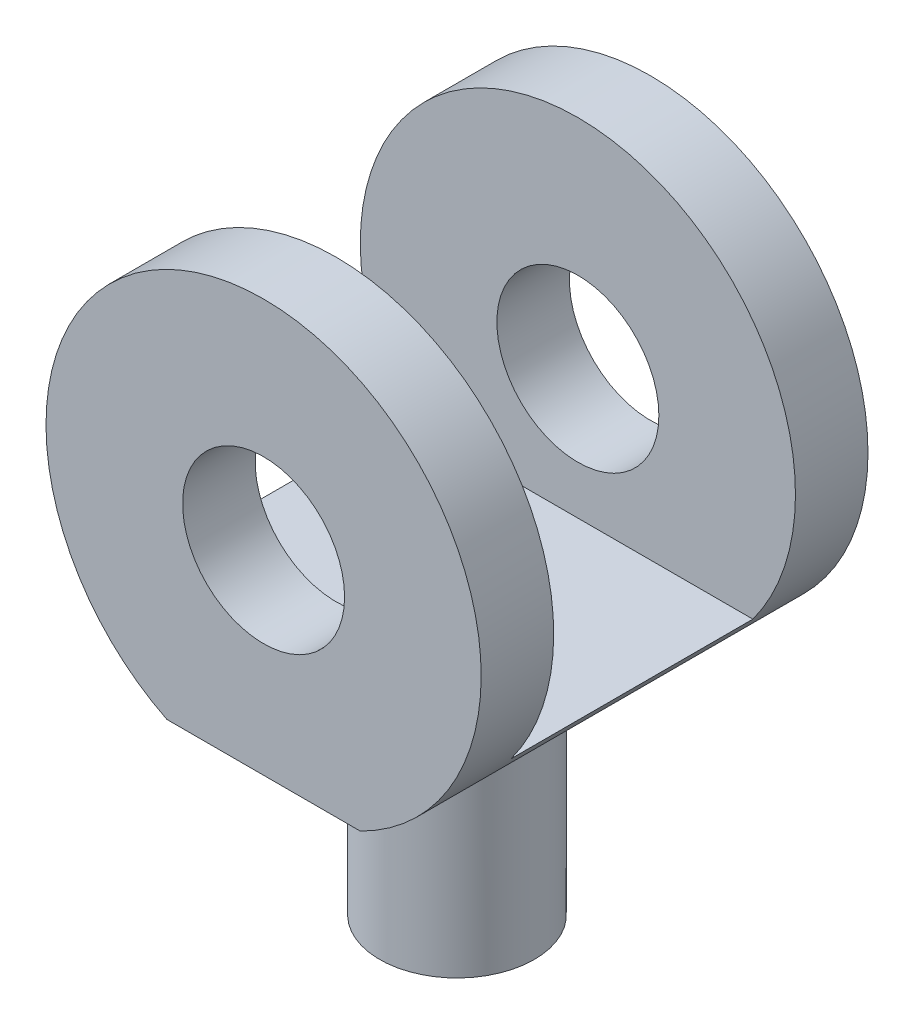
ISO-10303-21;
HEADER;
FILE_DESCRIPTION(('STEP AP214'),'2;1');
FILE_NAME('part.step','',(''),(''),'','','');
FILE_SCHEMA(('AUTOMOTIVE_DESIGN { 1 0 10303 214 1 1 1 1 }'));
ENDSEC;
DATA;
#1=APPLICATION_CONTEXT('core data for automotive mechanical design processes');
#2=APPLICATION_PROTOCOL_DEFINITION('international standard','automotive_design',2000,#1);
#3=PRODUCT_CONTEXT('',#1,'mechanical');
#4=PRODUCT('Part','Part','',(#3));
#5=PRODUCT_RELATED_PRODUCT_CATEGORY('part','',(#4));
#6=PRODUCT_DEFINITION_FORMATION('','',#4);
#7=PRODUCT_DEFINITION_CONTEXT('part definition',#1,'design');
#8=PRODUCT_DEFINITION('design','',#6,#7);
#9=PRODUCT_DEFINITION_SHAPE('','',#8);
#10=(LENGTH_UNIT() NAMED_UNIT(*) SI_UNIT(.MILLI.,.METRE.));
#11=(NAMED_UNIT(*) PLANE_ANGLE_UNIT() SI_UNIT($,.RADIAN.));
#12=(NAMED_UNIT(*) SI_UNIT($,.STERADIAN.) SOLID_ANGLE_UNIT());
#13=UNCERTAINTY_MEASURE_WITH_UNIT(LENGTH_MEASURE(1.E-05),#10,'distance_accuracy_value','');
#14=(GEOMETRIC_REPRESENTATION_CONTEXT(3) GLOBAL_UNCERTAINTY_ASSIGNED_CONTEXT((#13)) GLOBAL_UNIT_ASSIGNED_CONTEXT((#10,
#11,#12)) REPRESENTATION_CONTEXT('',''));
#15=CARTESIAN_POINT('',(0.,0.,0.));
#16=DIRECTION('',(0.,0.,1.));
#17=DIRECTION('',(1.,0.,0.));
#18=AXIS2_PLACEMENT_3D('',#15,#16,#17);
#19=CARTESIAN_POINT('',(13.,-4.03112887414927,4.));
#20=DIRECTION('',(0.,1.,0.));
#21=DIRECTION('',(0.,0.,1.));
#22=AXIS2_PLACEMENT_3D('',#19,#20,#21);
#23=PLANE('',#22);
#24=DIRECTION('',(0.,0.,-1.));
#25=VECTOR('',#24,1.);
#26=CARTESIAN_POINT('',(17.,-4.03112887414927,4.));
#27=LINE('',#26,#25);
#28=CARTESIAN_POINT('',(17.,-4.03112887414927,-0.640312423743286));
#29=VERTEX_POINT('',#28);
#30=CARTESIAN_POINT('',(17.,-4.03112887414927,-4.));
#31=VERTEX_POINT('',#30);
#32=EDGE_CURVE('E147',#29,#31,#27,.T.);
#33=ORIENTED_EDGE('',*,*,#32,.F.);
#34=CARTESIAN_POINT('',(15.,-4.03112887414927,0.));
#35=DIRECTION('',(0.,1.,0.));
#36=DIRECTION('',(0.,0.,1.));
#37=AXIS2_PLACEMENT_3D('',#34,#35,#36);
#38=CIRCLE('',#37,2.1);
#39=CARTESIAN_POINT('',(13.,-4.03112887414927,-0.640312423743292));
#40=VERTEX_POINT('',#39);
#41=EDGE_CURVE('E11',#29,#40,#38,.T.);
#42=ORIENTED_EDGE('',*,*,#41,.T.);
#43=DIRECTION('',(0.,0.,-1.));
#44=VECTOR('',#43,1.);
#45=CARTESIAN_POINT('',(13.,-4.03112887414927,4.));
#46=LINE('',#45,#44);
#47=CARTESIAN_POINT('',(13.,-4.03112887414927,-4.));
#48=VERTEX_POINT('',#47);
#49=EDGE_CURVE('E155',#40,#48,#46,.T.);
#50=ORIENTED_EDGE('',*,*,#49,.T.);
#51=DIRECTION('',(1.,0.,0.));
#52=VECTOR('',#51,1.);
#53=CARTESIAN_POINT('',(13.,-4.03112887414927,-4.));
#54=LINE('',#53,#52);
#55=EDGE_CURVE('E145',#48,#31,#54,.T.);
#56=ORIENTED_EDGE('',*,*,#55,.T.);
#57=EDGE_LOOP('',(#33,#42,#50,#56));
#58=FACE_BOUND('',#57,.T.);
#59=ADVANCED_FACE('F38',(#58),#23,.F.);
#60=CARTESIAN_POINT('',(15.,0.,4.));
#61=DIRECTION('',(0.,0.,-1.));
#62=DIRECTION('',(-1.,0.,0.));
#63=AXIS2_PLACEMENT_3D('',#60,#61,#62);
#64=CYLINDRICAL_SURFACE('',#63,4.5);
#65=CARTESIAN_POINT('',(15.,0.,-4.));
#66=DIRECTION('',(0.,0.,1.));
#67=DIRECTION('',(1.,0.,0.));
#68=AXIS2_PLACEMENT_3D('',#65,#66,#67);
#69=CIRCLE('',#68,4.5);
#70=EDGE_CURVE('E136',#31,#48,#69,.T.);
#71=ORIENTED_EDGE('',*,*,#70,.T.);
#72=ORIENTED_EDGE('',*,*,#49,.F.);
#73=CARTESIAN_POINT('',(13.,-4.03112887414927,0.640312423743292));
#74=VERTEX_POINT('',#73);
#75=EDGE_CURVE('E64',#74,#40,#46,.T.);
#76=ORIENTED_EDGE('',*,*,#75,.F.);
#77=CARTESIAN_POINT('',(13.,-4.03112887414927,4.));
#78=VERTEX_POINT('',#77);
#79=EDGE_CURVE('E157',#78,#74,#46,.T.);
#80=ORIENTED_EDGE('',*,*,#79,.F.);
#81=CARTESIAN_POINT('',(15.,0.,4.));
#82=DIRECTION('',(0.,0.,1.));
#83=DIRECTION('',(1.,0.,0.));
#84=AXIS2_PLACEMENT_3D('',#81,#82,#83);
#85=CIRCLE('',#84,4.5);
#86=CARTESIAN_POINT('',(17.,-4.03112887414927,4.));
#87=VERTEX_POINT('',#86);
#88=EDGE_CURVE('E141',#87,#78,#85,.T.);
#89=ORIENTED_EDGE('',*,*,#88,.F.);
#90=CARTESIAN_POINT('',(17.,-4.03112887414927,0.640312423743286));
#91=VERTEX_POINT('',#90);
#92=EDGE_CURVE('E152',#87,#91,#27,.T.);
#93=ORIENTED_EDGE('',*,*,#92,.T.);
#94=EDGE_CURVE('E156',#91,#29,#27,.T.);
#95=ORIENTED_EDGE('',*,*,#94,.T.);
#96=ORIENTED_EDGE('',*,*,#32,.T.);
#97=EDGE_LOOP('',(#71,#72,#76,#80,#89,#93,#95,#96));
#98=FACE_BOUND('',#97,.T.);
#99=CARTESIAN_POINT('',(15.,0.,-2.5));
#100=DIRECTION('',(0.,0.,1.));
#101=DIRECTION('',(1.,0.,0.));
#102=AXIS2_PLACEMENT_3D('',#99,#100,#101);
#103=CIRCLE('',#102,4.5);
#104=CARTESIAN_POINT('',(18.618615066569,-2.675,-2.5));
#105=VERTEX_POINT('',#104);
#106=CARTESIAN_POINT('',(11.381384933431,-2.675,-2.5));
#107=VERTEX_POINT('',#106);
#108=EDGE_CURVE('E109',#105,#107,#103,.T.);
#109=ORIENTED_EDGE('',*,*,#108,.F.);
#110=DIRECTION('',(0.,0.,1.));
#111=VECTOR('',#110,1.);
#112=CARTESIAN_POINT('',(18.618615066569,-2.675,-2.5));
#113=LINE('',#112,#111);
#114=CARTESIAN_POINT('',(18.618615066569,-2.675,2.5));
#115=VERTEX_POINT('',#114);
#116=EDGE_CURVE('E124',#105,#115,#113,.T.);
#117=ORIENTED_EDGE('',*,*,#116,.T.);
#118=CARTESIAN_POINT('',(15.,0.,2.5));
#119=DIRECTION('',(0.,0.,1.));
#120=DIRECTION('',(1.,0.,0.));
#121=AXIS2_PLACEMENT_3D('',#118,#119,#120);
#122=CIRCLE('',#121,4.5);
#123=CARTESIAN_POINT('',(11.381384933431,-2.675,2.5));
#124=VERTEX_POINT('',#123);
#125=EDGE_CURVE('E127',#115,#124,#122,.T.);
#126=ORIENTED_EDGE('',*,*,#125,.T.);
#127=DIRECTION('',(0.,0.,1.));
#128=VECTOR('',#127,1.);
#129=CARTESIAN_POINT('',(11.381384933431,-2.675,-2.5));
#130=LINE('',#129,#128);
#131=EDGE_CURVE('E122',#107,#124,#130,.T.);
#132=ORIENTED_EDGE('',*,*,#131,.F.);
#133=EDGE_LOOP('',(#109,#117,#126,#132));
#134=FACE_BOUND('',#133,.T.);
#135=ADVANCED_FACE('F126',(#98,#134),#64,.T.);
#136=CARTESIAN_POINT('',(15.,0.,4.));
#137=DIRECTION('',(0.,0.,-1.));
#138=DIRECTION('',(-1.,0.,0.));
#139=AXIS2_PLACEMENT_3D('',#136,#137,#138);
#140=CYLINDRICAL_SURFACE('',#139,1.675);
#141=CARTESIAN_POINT('',(15.,0.,-4.));
#142=DIRECTION('',(0.,0.,1.));
#143=DIRECTION('',(1.,0.,0.));
#144=AXIS2_PLACEMENT_3D('',#141,#142,#143);
#145=CIRCLE('',#144,1.675);
#146=CARTESIAN_POINT('',(16.675,0.,-4.));
#147=VERTEX_POINT('',#146);
#148=EDGE_CURVE('E137',#147,#147,#145,.T.);
#149=ORIENTED_EDGE('',*,*,#148,.F.);
#150=EDGE_LOOP('',(#149));
#151=FACE_BOUND('',#150,.T.);
#152=CARTESIAN_POINT('',(15.,0.,-2.5));
#153=DIRECTION('',(0.,0.,1.));
#154=DIRECTION('',(1.,0.,0.));
#155=AXIS2_PLACEMENT_3D('',#152,#153,#154);
#156=CIRCLE('',#155,1.675);
#157=CARTESIAN_POINT('',(16.675,0.,-2.5));
#158=VERTEX_POINT('',#157);
#159=EDGE_CURVE('E140',#158,#158,#156,.T.);
#160=ORIENTED_EDGE('',*,*,#159,.T.);
#161=EDGE_LOOP('',(#160));
#162=FACE_BOUND('',#161,.T.);
#163=ADVANCED_FACE('F238',(#151,#162),#140,.F.);
#164=CARTESIAN_POINT('',(15.,0.,4.));
#165=DIRECTION('',(0.,0.,1.));
#166=DIRECTION('',(1.,0.,0.));
#167=AXIS2_PLACEMENT_3D('',#164,#165,#166);
#168=PLANE('',#167);
#169=ORIENTED_EDGE('',*,*,#88,.T.);
#170=DIRECTION('',(1.,0.,0.));
#171=VECTOR('',#170,1.);
#172=CARTESIAN_POINT('',(13.,-4.03112887414927,4.));
#173=LINE('',#172,#171);
#174=EDGE_CURVE('E144',#78,#87,#173,.T.);
#175=ORIENTED_EDGE('',*,*,#174,.T.);
#176=EDGE_LOOP('',(#169,#175));
#177=FACE_BOUND('',#176,.T.);
#178=CARTESIAN_POINT('',(15.,0.,4.));
#179=DIRECTION('',(0.,0.,1.));
#180=DIRECTION('',(1.,0.,0.));
#181=AXIS2_PLACEMENT_3D('',#178,#179,#180);
#182=CIRCLE('',#181,1.675);
#183=CARTESIAN_POINT('',(16.675,0.,4.));
#184=VERTEX_POINT('',#183);
#185=EDGE_CURVE('E133',#184,#184,#182,.T.);
#186=ORIENTED_EDGE('',*,*,#185,.F.);
#187=EDGE_LOOP('',(#186));
#188=FACE_BOUND('',#187,.T.);
#189=ADVANCED_FACE('F249',(#177,#188),#168,.T.);
#190=CARTESIAN_POINT('',(15.,0.,-4.));
#191=DIRECTION('',(0.,0.,1.));
#192=DIRECTION('',(1.,0.,0.));
#193=AXIS2_PLACEMENT_3D('',#190,#191,#192);
#194=PLANE('',#193);
#195=ORIENTED_EDGE('',*,*,#70,.F.);
#196=ORIENTED_EDGE('',*,*,#55,.F.);
#197=EDGE_LOOP('',(#195,#196));
#198=FACE_BOUND('',#197,.T.);
#199=ORIENTED_EDGE('',*,*,#148,.T.);
#200=EDGE_LOOP('',(#199));
#201=FACE_BOUND('',#200,.T.);
#202=ADVANCED_FACE('F241',(#198,#201),#194,.F.);
#203=ORIENTED_EDGE('',*,*,#79,.T.);
#204=CARTESIAN_POINT('',(15.,-4.03112887414927,0.));
#205=DIRECTION('',(0.,1.,0.));
#206=DIRECTION('',(0.,0.,1.));
#207=AXIS2_PLACEMENT_3D('',#204,#205,#206);
#208=CIRCLE('',#207,2.1);
#209=EDGE_CURVE('E51',#74,#91,#208,.T.);
#210=ORIENTED_EDGE('',*,*,#209,.T.);
#211=ORIENTED_EDGE('',*,*,#92,.F.);
#212=ORIENTED_EDGE('',*,*,#174,.F.);
#213=EDGE_LOOP('',(#203,#210,#211,#212));
#214=FACE_BOUND('',#213,.T.);
#215=ADVANCED_FACE('F198',(#214),#23,.F.);
#216=CARTESIAN_POINT('',(15.,0.,2.5));
#217=DIRECTION('',(0.,0.,1.));
#218=DIRECTION('',(1.,0.,0.));
#219=AXIS2_PLACEMENT_3D('',#216,#217,#218);
#220=CIRCLE('',#219,1.675);
#221=CARTESIAN_POINT('',(16.675,0.,2.5));
#222=VERTEX_POINT('',#221);
#223=EDGE_CURVE('E129',#222,#222,#220,.T.);
#224=ORIENTED_EDGE('',*,*,#223,.F.);
#225=EDGE_LOOP('',(#224));
#226=FACE_BOUND('',#225,.T.);
#227=ORIENTED_EDGE('',*,*,#185,.T.);
#228=EDGE_LOOP('',(#227));
#229=FACE_BOUND('',#228,.T.);
#230=ADVANCED_FACE('F240',(#226,#229),#140,.F.);
#231=CARTESIAN_POINT('',(11.381384933431,-2.675,-2.5));
#232=DIRECTION('',(0.,-1.,0.));
#233=DIRECTION('',(0.,0.,-1.));
#234=AXIS2_PLACEMENT_3D('',#231,#232,#233);
#235=PLANE('',#234);
#236=DIRECTION('',(1.,0.,0.));
#237=VECTOR('',#236,1.);
#238=CARTESIAN_POINT('',(11.381384933431,-2.675,2.5));
#239=LINE('',#238,#237);
#240=EDGE_CURVE('E116',#124,#115,#239,.T.);
#241=ORIENTED_EDGE('',*,*,#240,.T.);
#242=ORIENTED_EDGE('',*,*,#116,.F.);
#243=DIRECTION('',(1.,0.,0.));
#244=VECTOR('',#243,1.);
#245=CARTESIAN_POINT('',(11.381384933431,-2.675,-2.5));
#246=LINE('',#245,#244);
#247=EDGE_CURVE('E112',#107,#105,#246,.T.);
#248=ORIENTED_EDGE('',*,*,#247,.F.);
#249=ORIENTED_EDGE('',*,*,#131,.T.);
#250=EDGE_LOOP('',(#241,#242,#248,#249));
#251=FACE_BOUND('',#250,.T.);
#252=ADVANCED_FACE('F121',(#251),#235,.F.);
#253=CARTESIAN_POINT('',(15.,0.,-2.5));
#254=DIRECTION('',(0.,0.,1.));
#255=DIRECTION('',(1.,0.,0.));
#256=AXIS2_PLACEMENT_3D('',#253,#254,#255);
#257=PLANE('',#256);
#258=ORIENTED_EDGE('',*,*,#159,.F.);
#259=EDGE_LOOP('',(#258));
#260=FACE_BOUND('',#259,.T.);
#261=ORIENTED_EDGE('',*,*,#108,.T.);
#262=ORIENTED_EDGE('',*,*,#247,.T.);
#263=EDGE_LOOP('',(#261,#262));
#264=FACE_BOUND('',#263,.T.);
#265=ADVANCED_FACE('F111',(#260,#264),#257,.T.);
#266=CARTESIAN_POINT('',(15.,0.,2.5));
#267=DIRECTION('',(0.,0.,1.));
#268=DIRECTION('',(1.,0.,0.));
#269=AXIS2_PLACEMENT_3D('',#266,#267,#268);
#270=PLANE('',#269);
#271=ORIENTED_EDGE('',*,*,#223,.T.);
#272=EDGE_LOOP('',(#271));
#273=FACE_BOUND('',#272,.T.);
#274=ORIENTED_EDGE('',*,*,#125,.F.);
#275=ORIENTED_EDGE('',*,*,#240,.F.);
#276=EDGE_LOOP('',(#274,#275));
#277=FACE_BOUND('',#276,.T.);
#278=ADVANCED_FACE('F288',(#273,#277),#270,.F.);
#279=CARTESIAN_POINT('',(15.,-8.53112887414927,0.));
#280=DIRECTION('',(0.,1.,0.));
#281=DIRECTION('',(0.,0.,1.));
#282=AXIS2_PLACEMENT_3D('',#279,#280,#281);
#283=CYLINDRICAL_SURFACE('',#282,1.6);
#284=CARTESIAN_POINT('',(15.,-4.53112887414927,0.));
#285=DIRECTION('',(0.,1.,0.));
#286=DIRECTION('',(0.,0.,1.));
#287=AXIS2_PLACEMENT_3D('',#284,#285,#286);
#288=CIRCLE('',#287,1.6);
#289=CARTESIAN_POINT('',(13.4761904761905,-4.53112887414927,-0.487857084756794));
#290=VERTEX_POINT('',#289);
#291=CARTESIAN_POINT('',(16.5238095238095,-4.53112887414927,-0.48785708475679));
#292=VERTEX_POINT('',#291);
#293=EDGE_CURVE('E159',#290,#292,#288,.F.);
#294=ORIENTED_EDGE('',*,*,#293,.T.);
#295=CARTESIAN_POINT('',(16.4888858462852,-4.52902338052221,-0.58584890264617));
#296=CARTESIAN_POINT('',(16.495604399545,-3.9846930415507,-0.56877426307448));
#297=CARTESIAN_POINT('',(17.,-4.03112887414927,-0.768926684723097));
#298=CARTESIAN_POINT('',(16.5047087216664,-4.53087282978988,-0.545649396798599));
#299=CARTESIAN_POINT('',(16.5071011969737,-4.00661256081407,-0.538632279845096));
#300=CARTESIAN_POINT('',(17.,-4.03112887414927,-0.716164833298698));
#301=CARTESIAN_POINT('',(16.5188957207595,-4.53134120018803,-0.504803426177209));
#302=CARTESIAN_POINT('',(16.5191144380638,-4.02507277097412,-0.50394047095733));
#303=CARTESIAN_POINT('',(17.,-4.03112887414927,-0.66255449685811));
#304=CARTESIAN_POINT('',(16.5439178224654,-4.53071766941821,-0.422112536578379));
#305=CARTESIAN_POINT('',(16.5417070406892,-4.0554409019921,-0.429553792395827));
#306=CARTESIAN_POINT('',(17.,-4.03112887414927,-0.554022704259361));
#307=CARTESIAN_POINT('',(16.5547538889516,-4.5296262174315,-0.380267908595473));
#308=CARTESIAN_POINT('',(16.5524200093672,-4.06766899038923,-0.389714590337836));
#309=CARTESIAN_POINT('',(17.,-4.03112887414927,-0.499101630031528));
#310=CARTESIAN_POINT('',(16.5729929186575,-4.52708603833834,-0.295897682407606));
#311=CARTESIAN_POINT('',(16.5708681693814,-4.08707230972244,-0.30704625203726));
#312=CARTESIAN_POINT('',(17.,-4.03112887414927,-0.388365708160012));
#313=CARTESIAN_POINT('',(16.5803997291644,-4.52563771441696,-0.253372902971893));
#314=CARTESIAN_POINT('',(16.578743115947,-4.09443759562216,-0.263957033985236));
#315=CARTESIAN_POINT('',(17.,-4.03112887414927,-0.332551935150965));
#316=CARTESIAN_POINT('',(16.5917551202329,-4.52317111905424,-0.167855789627461));
#317=CARTESIAN_POINT('',(16.5908941406333,-4.10531074502866,-0.176206134451724));
#318=CARTESIAN_POINT('',(17.,-4.03112887414927,-0.220310723886435));
#319=CARTESIAN_POINT('',(16.5957037702311,-4.52215283897825,-0.124863465124153));
#320=CARTESIAN_POINT('',(16.5952656009346,-4.10891229623714,-0.13121632583699));
#321=CARTESIAN_POINT('',(17.,-4.03112887414927,-0.163883297975554));
#322=CARTESIAN_POINT('',(16.6001655862916,-4.52099185828215,-0.0376790739076369));
#323=CARTESIAN_POINT('',(16.6001708647559,-4.11293393870704,-0.0398251298144395));
#324=CARTESIAN_POINT('',(17.,-4.03112887414927,-0.049453784503668));
#325=CARTESIAN_POINT('',(16.6005958505695,-4.52087029287808,0.00651744712164403));
#326=CARTESIAN_POINT('',(16.6006535447355,-4.11331146720379,0.00697050575203776));
#327=CARTESIAN_POINT('',(17.,-4.03112887414927,0.00855414934717325));
#328=CARTESIAN_POINT('',(16.5977995911753,-4.5216108792086,0.0948067792502726));
#329=CARTESIAN_POINT('',(16.5975713104231,-4.11080896518121,0.0997311807553541));
#330=CARTESIAN_POINT('',(17.,-4.03112887414927,0.124433897765971));
#331=CARTESIAN_POINT('',(16.5945715332132,-4.52247344368553,0.138899539058206));
#332=CARTESIAN_POINT('',(16.593978633578,-4.10790649870522,0.14608443310764));
#333=CARTESIAN_POINT('',(17.,-4.03112887414927,0.182305645013946));
#334=CARTESIAN_POINT('',(16.5844898663786,-4.52479065491683,0.226570880750185));
#335=CARTESIAN_POINT('',(16.5830981448649,-4.09841483463815,0.236625345025142));
#336=CARTESIAN_POINT('',(17.,-4.03112887414927,0.297374280984566));
#337=CARTESIAN_POINT('',(16.5776435315722,-4.52624411241109,0.270150315551972));
#338=CARTESIAN_POINT('',(16.5757276275863,-4.09174894987996,0.28117876466437));
#339=CARTESIAN_POINT('',(17.,-4.03112887414927,0.354572289161747));
#340=CARTESIAN_POINT('',(16.5603788692848,-4.52894924994654,0.356599564960278));
#341=CARTESIAN_POINT('',(16.5580363594046,-4.07381752870032,0.366862597596311));
#342=CARTESIAN_POINT('',(17.,-4.03112887414927,0.468036929010832));
#343=CARTESIAN_POINT('',(16.5499597880624,-4.53020088732781,0.399469227824142));
#344=CARTESIAN_POINT('',(16.5475767857224,-4.06237721143196,0.408290374004864));
#345=CARTESIAN_POINT('',(17.,-4.03112887414927,0.524303361520501));
#346=CARTESIAN_POINT('',(16.5214279413246,-4.53158687165993,0.498751913446822));
#347=CARTESIAN_POINT('',(16.5209271910348,-4.02834286862216,0.499760720687006));
#348=CARTESIAN_POINT('',(17.,-4.03112887414927,0.654611886397188));
#349=CARTESIAN_POINT('',(16.5019025764262,-4.53119265036849,0.554782091040925));
#350=CARTESIAN_POINT('',(16.5038517405898,-4.00282217902221,0.547666371626742));
#351=CARTESIAN_POINT('',(17.,-4.03112887414927,0.728151494483789));
#352=CARTESIAN_POINT('',(16.4681077220619,-4.52597708562385,0.636817416044626));
#353=CARTESIAN_POINT('',(16.4810225405352,-3.95451503678211,0.6067155815828));
#354=CARTESIAN_POINT('',(17.,-4.03112887414927,0.835822858562288));
#355=CARTESIAN_POINT('',(16.4560840568468,-4.52346529595911,0.663841341038449));
#356=CARTESIAN_POINT('',(16.4736944746587,-3.93611357667352,0.624650022181836));
#357=CARTESIAN_POINT('',(17.,-4.03112887414927,0.871291760123675));
#358=CARTESIAN_POINT('',(16.4306153433953,-4.51623379178911,0.717088268725743));
#359=CARTESIAN_POINT('',(16.4613786700981,-3.89536326065902,0.655244280097869));
#360=CARTESIAN_POINT('',(17.,-4.03112887414927,0.941178352718408));
#361=CARTESIAN_POINT('',(16.4171678206746,-4.51151018301853,0.743309771525755));
#362=CARTESIAN_POINT('',(16.4564575771574,-3.87278605861185,0.667759237388947));
#363=CARTESIAN_POINT('',(17.,-4.03112887414927,0.975594075141572));
#364=CARTESIAN_POINT('',(16.4030699315797,-4.50535143007672,0.769021954886224));
#365=CARTESIAN_POINT('',(16.4537699773339,-3.84859546013085,0.67652042189945));
#366=CARTESIAN_POINT('',(17.,-4.03112887414927,1.00934131578817));
#367=(BOUNDED_SURFACE() B_SPLINE_SURFACE(3,2,((#295,#296,#297),(#298,#299,#300),(#301,#302,
#303),(#304,#305,#306),(#307,#308,#309),(#310,#311,#312),(#313,#314,#315),(#316,#317,#318),
(#319,#320,#321),(#322,#323,#324),(#325,#326,#327),(#328,#329,#330),(#331,#332,#333),(#334,#335,
#336),(#337,#338,#339),(#340,#341,#342),(#343,#344,#345),(#346,#347,#348),(#349,#350,#351),
(#352,#353,#354),(#355,#356,#357),(#358,#359,#360),(#361,#362,#363),(#364,#365,#366)),
.UNSPECIFIED.,.F.,.F.,.F.) B_SPLINE_SURFACE_WITH_KNOTS((4,2,2,2,2,2,2,2,2,2,2,4),(3,3),(0.,
0.170076467679544,0.340103968393143,0.50994024999735,0.679773121371831,0.853596468173171,
1.02749274298513,1.20104074481935,1.37462538258744,1.60758110338001,1.72418278856556,
1.84099054629239),(0.,1.),
.UNSPECIFIED.) GEOMETRIC_REPRESENTATION_ITEM() RATIONAL_B_SPLINE_SURFACE(((1.,0.67627354532453,
1.),(1.,0.690228517694845,1.),(1.,0.702760459109967,1.),(1.,0.72488642548295,1.),(1.,
0.734481295261849,1.),(1.,0.75064030963871,1.),(1.,0.757207850564747,1.),(1.,0.767279560425734,
1.),(1.,0.770783790869052,1.),(1.,0.774743538991764,1.),(1.,0.775125488006705,1.),(1.,
0.77264373776079,1.),(1.,0.769778676713023,1.),(1.,0.760835087267262,1.),(1.,0.754763006173832,
1.),(1.,0.739463417539729,1.),(1.,0.73023524416002,1.),(1.,0.704994447740141,1.),(1.,
0.687740893016197,1.),(1.,0.657960849800565,1.),(1.,0.647377563445325,1.),(1.,0.624999339662009,
1.),(1.,0.613202293914292,1.),(1.,0.600861103451678,1.))) REPRESENTATION_ITEM('') SURFACE());
#368=CARTESIAN_POINT('',(16.4888858462852,-4.52902338052221,-0.58584890264617));
#369=CARTESIAN_POINT('',(16.5047087216664,-4.53087282978987,-0.545649396798599));
#370=CARTESIAN_POINT('',(16.5188957207595,-4.53134120018803,-0.50480342617721));
#371=CARTESIAN_POINT('',(16.5439178224654,-4.53071766941821,-0.422112536578379));
#372=CARTESIAN_POINT('',(16.5547538889516,-4.5296262174315,-0.380267908595473));
#373=CARTESIAN_POINT('',(16.5729929186575,-4.52708603833834,-0.295897682407606));
#374=CARTESIAN_POINT('',(16.5803997291644,-4.52563771441696,-0.253372902971893));
#375=CARTESIAN_POINT('',(16.5917551202329,-4.52317111905424,-0.167855789627461));
#376=CARTESIAN_POINT('',(16.5957037702311,-4.52215283897825,-0.124863465124153));
#377=CARTESIAN_POINT('',(16.6001655862917,-4.52099185828215,-0.0376790739076369));
#378=CARTESIAN_POINT('',(16.6005958505695,-4.52087029287808,0.006517447121644));
#379=CARTESIAN_POINT('',(16.5977995911753,-4.5216108792086,0.0948067792502727));
#380=CARTESIAN_POINT('',(16.5945715332132,-4.52247344368553,0.138899539058206));
#381=CARTESIAN_POINT('',(16.5844898663786,-4.52479065491683,0.226570880750185));
#382=CARTESIAN_POINT('',(16.5776435315722,-4.52624411241109,0.270150315551972));
#383=CARTESIAN_POINT('',(16.5603788692848,-4.52894924994655,0.356599564960278));
#384=CARTESIAN_POINT('',(16.5499597880624,-4.53020088732781,0.399469227824142));
#385=CARTESIAN_POINT('',(16.5214279413246,-4.53158687165993,0.498751913446822));
#386=CARTESIAN_POINT('',(16.5019025764262,-4.53119265036849,0.554782091040925));
#387=CARTESIAN_POINT('',(16.4681077220619,-4.52597708562385,0.636817416044626));
#388=CARTESIAN_POINT('',(16.4560840568468,-4.52346529595911,0.663841341038449));
#389=CARTESIAN_POINT('',(16.4306153433953,-4.51623379178911,0.717088268725743));
#390=CARTESIAN_POINT('',(16.4171678206746,-4.51151018301853,0.743309771525755));
#391=CARTESIAN_POINT('',(16.4030699315797,-4.50535143007672,0.769021954886224));
#392=B_SPLINE_CURVE_WITH_KNOTS('',3,(#368,#369,#370,#371,#372,#373,#374,#375,#376,#377,#378,
#379,#380,#381,#382,#383,#384,#385,#386,#387,#388,#389,#390,#391),.UNSPECIFIED.,.F.,.F.,(4,2,2,
2,2,2,2,2,2,2,2,4),(0.,0.170076467679544,0.340103968393143,0.50994024999735,0.679773121371831,
0.853596468173171,1.02749274298513,1.20104074481935,1.37462538258744,1.60758110338001,
1.72418278856556,1.84099054629239),.UNSPECIFIED.);
#393=CARTESIAN_POINT('',(16.5238095238095,-4.53112887414927,0.48785708475679));
#394=VERTEX_POINT('',#393);
#395=EDGE_CURVE('E260',#292,#394,#392,.T.);
#396=ORIENTED_EDGE('',*,*,#395,.T.);
#397=CARTESIAN_POINT('',(15.,-4.53112887414927,0.));
#398=DIRECTION('',(0.,1.,0.));
#399=DIRECTION('',(0.,0.,1.));
#400=AXIS2_PLACEMENT_3D('',#397,#398,#399);
#401=CIRCLE('',#400,1.6);
#402=CARTESIAN_POINT('',(13.4761904761905,-4.53112887414927,0.487857084756794));
#403=VERTEX_POINT('',#402);
#404=EDGE_CURVE('E173',#394,#403,#401,.F.);
#405=ORIENTED_EDGE('',*,*,#404,.T.);
#406=CARTESIAN_POINT('',(13.5111141537148,-4.52902338052221,0.585848902646155));
#407=CARTESIAN_POINT('',(13.5043956004549,-3.98469304155071,0.568774263074468));
#408=CARTESIAN_POINT('',(13.,-4.03112887414927,0.768926684723078));
#409=CARTESIAN_POINT('',(13.4952912783336,-4.53087282978988,0.545649396798583));
#410=CARTESIAN_POINT('',(13.4928988030263,-4.00661256081408,0.538632279845084));
#411=CARTESIAN_POINT('',(13.,-4.03112887414927,0.716164833298678));
#412=CARTESIAN_POINT('',(13.4811042792405,-4.53134120018803,0.504803426177193));
#413=CARTESIAN_POINT('',(13.4808855619362,-4.02507277097413,0.503940470957316));
#414=CARTESIAN_POINT('',(13.,-4.03112887414927,0.662554496858089));
#415=CARTESIAN_POINT('',(13.4560821775346,-4.53071766941821,0.422112536578362));
#416=CARTESIAN_POINT('',(13.4582929593108,-4.0554409019921,0.429553792395812));
#417=CARTESIAN_POINT('',(13.,-4.03112887414927,0.554022704259339));
#418=CARTESIAN_POINT('',(13.4452461110484,-4.5296262174315,0.380267908595456));
#419=CARTESIAN_POINT('',(13.4475799906328,-4.06766899038923,0.389714590337819));
#420=CARTESIAN_POINT('',(13.,-4.03112887414927,0.499101630031506));
#421=CARTESIAN_POINT('',(13.4270070813425,-4.52708603833834,0.295897682407588));
#422=CARTESIAN_POINT('',(13.4291318306186,-4.08707230972244,0.307046252037242));
#423=CARTESIAN_POINT('',(13.,-4.03112887414927,0.388365708159989));
#424=CARTESIAN_POINT('',(13.4196002708356,-4.52563771441696,0.253372902971874));
#425=CARTESIAN_POINT('',(13.421256884053,-4.09443759562217,0.263957033985217));
#426=CARTESIAN_POINT('',(13.,-4.03112887414927,0.332551935150941));
#427=CARTESIAN_POINT('',(13.4082448797671,-4.52317111905424,0.167855789627441));
#428=CARTESIAN_POINT('',(13.4091058593667,-4.10531074502866,0.176206134451703));
#429=CARTESIAN_POINT('',(13.,-4.03112887414927,0.220310723886409));
#430=CARTESIAN_POINT('',(13.4042962297689,-4.52215283897825,0.124863465124133));
#431=CARTESIAN_POINT('',(13.4047343990654,-4.10891229623714,0.131216325836969));
#432=CARTESIAN_POINT('',(13.,-4.03112887414927,0.163883297975527));
#433=CARTESIAN_POINT('',(13.3998344137083,-4.52099185828215,0.0376790739076155));
#434=CARTESIAN_POINT('',(13.3998291352441,-4.11293393870704,0.0398251298144164));
#435=CARTESIAN_POINT('',(13.,-4.03112887414927,0.0494537845036396));
#436=CARTESIAN_POINT('',(13.3994041494305,-4.52087029287808,-0.00651744712166579));
#437=CARTESIAN_POINT('',(13.3993464552646,-4.11331146720379,-0.00697050575206099));
#438=CARTESIAN_POINT('',(13.,-4.03112887414927,-0.00855414934720228));
#439=CARTESIAN_POINT('',(13.4022004088247,-4.5216108792086,-0.094806779250295));
#440=CARTESIAN_POINT('',(13.4024286895769,-4.1108089651812,-0.099731180755378));
#441=CARTESIAN_POINT('',(13.,-4.03112887414927,-0.124433897766001));
#442=CARTESIAN_POINT('',(13.4054284667868,-4.52247344368553,-0.138899539058228));
#443=CARTESIAN_POINT('',(13.406021366422,-4.10790649870522,-0.146084433107664));
#444=CARTESIAN_POINT('',(13.,-4.03112887414927,-0.182305645013976));
#445=CARTESIAN_POINT('',(13.4155101336214,-4.52479065491683,-0.226570880750208));
#446=CARTESIAN_POINT('',(13.4169018551351,-4.09841483463815,-0.236625345025166));
#447=CARTESIAN_POINT('',(13.,-4.03112887414927,-0.297374280984597));
#448=CARTESIAN_POINT('',(13.4223564684278,-4.52624411241109,-0.270150315551995));
#449=CARTESIAN_POINT('',(13.4242723724137,-4.09174894987996,-0.281178764664394));
#450=CARTESIAN_POINT('',(13.,-4.03112887414927,-0.354572289161778));
#451=CARTESIAN_POINT('',(13.4396211307152,-4.52894924994655,-0.356599564960302));
#452=CARTESIAN_POINT('',(13.4419636405954,-4.07381752870031,-0.366862597596334));
#453=CARTESIAN_POINT('',(13.,-4.03112887414927,-0.468036929010863));
#454=CARTESIAN_POINT('',(13.4500402119376,-4.53020088732781,-0.399469227824166));
#455=CARTESIAN_POINT('',(13.4524232142776,-4.06237721143195,-0.408290374004886));
#456=CARTESIAN_POINT('',(13.,-4.03112887414927,-0.524303361520532));
#457=CARTESIAN_POINT('',(13.4785720586754,-4.53158687165993,-0.498751913446842));
#458=CARTESIAN_POINT('',(13.4790728089652,-4.02834286862215,-0.499760720687023));
#459=CARTESIAN_POINT('',(13.,-4.03112887414927,-0.654611886397215));
#460=CARTESIAN_POINT('',(13.4980974235738,-4.53119265036849,-0.554782091040942));
#461=CARTESIAN_POINT('',(13.4961482594102,-4.00282217902219,-0.547666371626754));
#462=CARTESIAN_POINT('',(13.,-4.03112887414927,-0.728151494483812));
#463=CARTESIAN_POINT('',(13.5318922779381,-4.52597708562385,-0.636817416044638));
#464=CARTESIAN_POINT('',(13.5189774594648,-3.9545150367821,-0.606715581582808));
#465=CARTESIAN_POINT('',(13.,-4.03112887414927,-0.835822858562304));
#466=CARTESIAN_POINT('',(13.5439159431532,-4.52346529595911,-0.66384134103846));
#467=CARTESIAN_POINT('',(13.5263055253413,-3.93611357667351,-0.624650022181843));
#468=CARTESIAN_POINT('',(13.,-4.03112887414927,-0.871291760123689));
#469=CARTESIAN_POINT('',(13.5693846566047,-4.51623379178911,-0.717088268725751));
#470=CARTESIAN_POINT('',(13.5386213299019,-3.89536326065902,-0.655244280097873));
#471=CARTESIAN_POINT('',(13.,-4.03112887414927,-0.941178352718418));
#472=CARTESIAN_POINT('',(13.5828321793254,-4.51151018301853,-0.743309771525761));
#473=CARTESIAN_POINT('',(13.5435424228426,-3.87278605861184,-0.66775923738895));
#474=CARTESIAN_POINT('',(13.,-4.03112887414927,-0.975594075141581));
#475=CARTESIAN_POINT('',(13.5969300684203,-4.50535143007672,-0.76902195488623));
#476=CARTESIAN_POINT('',(13.5462300226661,-3.84859546013084,-0.67652042189945));
#477=CARTESIAN_POINT('',(13.,-4.03112887414927,-1.00934131578818));
#478=(BOUNDED_SURFACE() B_SPLINE_SURFACE(3,2,((#406,#407,#408),(#409,#410,#411),(#412,#413,
#414),(#415,#416,#417),(#418,#419,#420),(#421,#422,#423),(#424,#425,#426),(#427,#428,#429),
(#430,#431,#432),(#433,#434,#435),(#436,#437,#438),(#439,#440,#441),(#442,#443,#444),(#445,#446,
#447),(#448,#449,#450),(#451,#452,#453),(#454,#455,#456),(#457,#458,#459),(#460,#461,#462),
(#463,#464,#465),(#466,#467,#468),(#469,#470,#471),(#472,#473,#474),(#475,#476,#477)),
.UNSPECIFIED.,.F.,.F.,.F.) B_SPLINE_SURFACE_WITH_KNOTS((4,2,2,2,2,2,2,2,2,2,2,4),(3,3),(0.,
0.170076467679546,0.340103968393145,0.509940249997355,0.679773121371838,0.853596468173179,
1.02749274298514,1.20104074481936,1.37462538258745,1.60758110338,1.72418278856555,
1.84099054629237),(0.,1.),
.UNSPECIFIED.) GEOMETRIC_REPRESENTATION_ITEM() RATIONAL_B_SPLINE_SURFACE(((1.,0.676273545324534,
1.),(1.,0.69022851769485,1.),(1.,0.702760459109971,1.),(1.,0.724886425482953,1.),(1.,
0.734481295261852,1.),(1.,0.750640309638712,1.),(1.,0.757207850564749,1.),(1.,0.767279560425735,
1.),(1.,0.770783790869052,1.),(1.,0.774743538991762,1.),(1.,0.775125488006703,1.),(1.,
0.772643737760787,1.),(1.,0.76977867671302,1.),(1.,0.760835087267259,1.),(1.,0.754763006173828,
1.),(1.,0.739463417539723,1.),(1.,0.730235244160014,1.),(1.,0.704994447740134,1.),(1.,
0.687740893016191,1.),(1.,0.657960849800559,1.),(1.,0.64737756344532,1.),(1.,0.624999339662004,
1.),(1.,0.613202293914288,1.),(1.,0.600861103451675,1.))) REPRESENTATION_ITEM('') SURFACE());
#479=CARTESIAN_POINT('',(13.5111141537148,-4.52902338052221,0.585848902646155));
#480=CARTESIAN_POINT('',(13.4952912783336,-4.53087282978987,0.545649396798583));
#481=CARTESIAN_POINT('',(13.4811042792405,-4.53134120018803,0.504803426177193));
#482=CARTESIAN_POINT('',(13.4560821775346,-4.53071766941821,0.422112536578362));
#483=CARTESIAN_POINT('',(13.4452461110484,-4.5296262174315,0.380267908595456));
#484=CARTESIAN_POINT('',(13.4270070813425,-4.52708603833834,0.295897682407588));
#485=CARTESIAN_POINT('',(13.4196002708356,-4.52563771441696,0.253372902971874));
#486=CARTESIAN_POINT('',(13.4082448797671,-4.52317111905424,0.167855789627441));
#487=CARTESIAN_POINT('',(13.4042962297689,-4.52215283897825,0.124863465124133));
#488=CARTESIAN_POINT('',(13.3998344137083,-4.52099185828215,0.0376790739076155));
#489=CARTESIAN_POINT('',(13.3994041494305,-4.52087029287808,-0.00651744712166581));
#490=CARTESIAN_POINT('',(13.4022004088247,-4.5216108792086,-0.094806779250295));
#491=CARTESIAN_POINT('',(13.4054284667868,-4.52247344368553,-0.138899539058228));
#492=CARTESIAN_POINT('',(13.4155101336214,-4.52479065491683,-0.226570880750208));
#493=CARTESIAN_POINT('',(13.4223564684278,-4.52624411241109,-0.270150315551995));
#494=CARTESIAN_POINT('',(13.4396211307152,-4.52894924994655,-0.356599564960302));
#495=CARTESIAN_POINT('',(13.4500402119376,-4.53020088732781,-0.399469227824166));
#496=CARTESIAN_POINT('',(13.4785720586754,-4.53158687165993,-0.498751913446842));
#497=CARTESIAN_POINT('',(13.4980974235738,-4.53119265036849,-0.554782091040942));
#498=CARTESIAN_POINT('',(13.5318922779381,-4.52597708562385,-0.636817416044638));
#499=CARTESIAN_POINT('',(13.5439159431532,-4.52346529595911,-0.66384134103846));
#500=CARTESIAN_POINT('',(13.5693846566047,-4.51623379178911,-0.717088268725751));
#501=CARTESIAN_POINT('',(13.5828321793254,-4.51151018301853,-0.743309771525761));
#502=CARTESIAN_POINT('',(13.5969300684203,-4.50535143007672,-0.76902195488623));
#503=B_SPLINE_CURVE_WITH_KNOTS('',3,(#479,#480,#481,#482,#483,#484,#485,#486,#487,#488,#489,
#490,#491,#492,#493,#494,#495,#496,#497,#498,#499,#500,#501,#502),.UNSPECIFIED.,.F.,.F.,(4,2,2,
2,2,2,2,2,2,2,2,4),(0.,0.170076467679546,0.340103968393145,0.509940249997355,0.679773121371838,
0.853596468173179,1.02749274298514,1.20104074481936,1.37462538258745,1.60758110338,
1.72418278856555,1.84099054629237),.UNSPECIFIED.);
#504=EDGE_CURVE('E165',#403,#290,#503,.T.);
#505=ORIENTED_EDGE('',*,*,#504,.T.);
#506=EDGE_LOOP('',(#294,#396,#405,#505));
#507=FACE_BOUND('',#506,.T.);
#508=CARTESIAN_POINT('',(15.,-8.53112887414927,0.));
#509=DIRECTION('',(0.,-1.,0.));
#510=DIRECTION('',(0.,0.,-1.));
#511=AXIS2_PLACEMENT_3D('',#508,#509,#510);
#512=CIRCLE('',#511,1.6);
#513=CARTESIAN_POINT('',(15.,-8.53112887414927,-1.6));
#514=VERTEX_POINT('',#513);
#515=EDGE_CURVE('E206',#514,#514,#512,.T.);
#516=ORIENTED_EDGE('',*,*,#515,.F.);
#517=EDGE_LOOP('',(#516));
#518=FACE_BOUND('',#517,.T.);
#519=ADVANCED_FACE('F175',(#507,#518),#283,.T.);
#520=CARTESIAN_POINT('',(15.,-8.53112887414927,0.));
#521=DIRECTION('',(0.,-1.,0.));
#522=DIRECTION('',(0.,0.,-1.));
#523=AXIS2_PLACEMENT_3D('',#520,#521,#522);
#524=PLANE('',#523);
#525=ORIENTED_EDGE('',*,*,#515,.T.);
#526=EDGE_LOOP('',(#525));
#527=FACE_BOUND('',#526,.T.);
#528=ADVANCED_FACE('F193',(#527),#524,.T.);
#529=CARTESIAN_POINT('',(13.,-4.53112887414927,0.640312423743293));
#530=DIRECTION('',(0.304910677972996,0.,0.952380952380951));
#531=DIRECTION('',(0.952380952380951,0.,-0.304910677972996));
#532=AXIS2_PLACEMENT_3D('',#529,#530,#531);
#533=CIRCLE('',#532,0.5);
#534=EDGE_CURVE('E207',#74,#403,#533,.F.);
#535=ORIENTED_EDGE('',*,*,#534,.F.);
#536=ORIENTED_EDGE('',*,*,#75,.T.);
#537=CARTESIAN_POINT('',(13.,-4.53112887414927,-0.640312423743291));
#538=DIRECTION('',(-0.304910677972996,0.,0.952380952380951));
#539=DIRECTION('',(0.952380952380952,0.,0.304910677972996));
#540=AXIS2_PLACEMENT_3D('',#537,#538,#539);
#541=CIRCLE('',#540,0.5);
#542=EDGE_CURVE('E203',#290,#40,#541,.T.);
#543=ORIENTED_EDGE('',*,*,#542,.F.);
#544=ORIENTED_EDGE('',*,*,#504,.F.);
#545=EDGE_LOOP('',(#535,#536,#543,#544));
#546=FACE_BOUND('',#545,.T.);
#547=ADVANCED_FACE('F187',(#546),#478,.F.);
#548=CARTESIAN_POINT('',(15.,-4.53112887414927,0.));
#549=DIRECTION('',(0.,1.,0.));
#550=DIRECTION('',(0.,0.,1.));
#551=AXIS2_PLACEMENT_3D('',#548,#549,#550);
#552=TOROIDAL_SURFACE('',#551,2.1,0.5);
#553=ORIENTED_EDGE('',*,*,#542,.T.);
#554=ORIENTED_EDGE('',*,*,#41,.F.);
#555=CARTESIAN_POINT('',(17.,-4.53112887414927,-0.640312423743286));
#556=DIRECTION('',(-0.304910677972993,0.,-0.952380952380953));
#557=DIRECTION('',(-0.952380952380953,0.,0.304910677972993));
#558=AXIS2_PLACEMENT_3D('',#555,#556,#557);
#559=CIRCLE('',#558,0.5);
#560=EDGE_CURVE('E210',#292,#29,#559,.T.);
#561=ORIENTED_EDGE('',*,*,#560,.F.);
#562=ORIENTED_EDGE('',*,*,#293,.F.);
#563=EDGE_LOOP('',(#553,#554,#561,#562));
#564=FACE_BOUND('',#563,.T.);
#565=ADVANCED_FACE('F192',(#564),#552,.F.);
#566=CARTESIAN_POINT('',(15.,-4.53112887414927,0.));
#567=DIRECTION('',(0.,1.,0.));
#568=DIRECTION('',(0.,0.,1.));
#569=AXIS2_PLACEMENT_3D('',#566,#567,#568);
#570=TOROIDAL_SURFACE('',#569,2.1,0.5);
#571=ORIENTED_EDGE('',*,*,#534,.T.);
#572=ORIENTED_EDGE('',*,*,#404,.F.);
#573=CARTESIAN_POINT('',(17.,-4.53112887414927,0.640312423743286));
#574=DIRECTION('',(-0.304910677972992,0.,0.952380952380953));
#575=DIRECTION('',(0.952380952380953,0.,0.304910677972992));
#576=AXIS2_PLACEMENT_3D('',#573,#574,#575);
#577=CIRCLE('',#576,0.5);
#578=EDGE_CURVE('E259',#91,#394,#577,.T.);
#579=ORIENTED_EDGE('',*,*,#578,.F.);
#580=ORIENTED_EDGE('',*,*,#209,.F.);
#581=EDGE_LOOP('',(#571,#572,#579,#580));
#582=FACE_BOUND('',#581,.T.);
#583=ADVANCED_FACE('F224',(#582),#570,.F.);
#584=ORIENTED_EDGE('',*,*,#560,.T.);
#585=ORIENTED_EDGE('',*,*,#94,.F.);
#586=ORIENTED_EDGE('',*,*,#578,.T.);
#587=ORIENTED_EDGE('',*,*,#395,.F.);
#588=EDGE_LOOP('',(#584,#585,#586,#587));
#589=FACE_BOUND('',#588,.T.);
#590=ADVANCED_FACE('F226',(#589),#367,.F.);
#591=CLOSED_SHELL('',(#59,#135,#163,#189,#202,#215,#230,#252,#265,#278,#519,#528,#547,#565,#583,#590));
#592=MANIFOLD_SOLID_BREP('B2',#591);
#593=ADVANCED_BREP_SHAPE_REPRESENTATION('',(#18,#592),#14);
#594=SHAPE_DEFINITION_REPRESENTATION(#9,#593);
ENDSEC;
END-ISO-10303-21;
